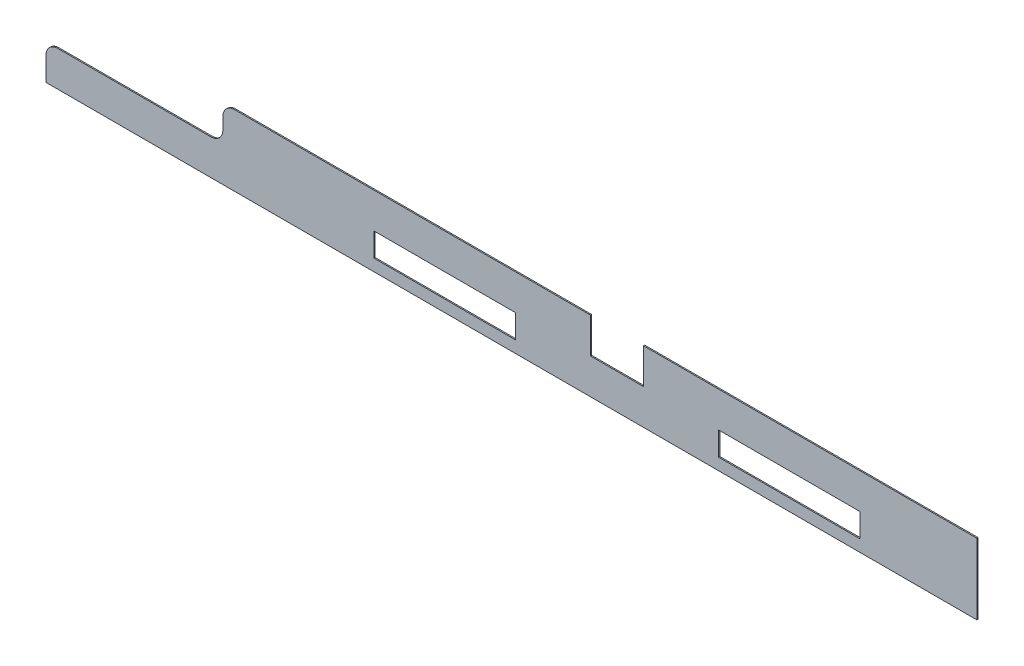
ISO-10303-21;
HEADER;
FILE_DESCRIPTION(('STEP AP214'),'2;1');
FILE_NAME('part.step','',(''),(''),'','','');
FILE_SCHEMA(('AUTOMOTIVE_DESIGN { 1 0 10303 214 1 1 1 1 }'));
ENDSEC;
DATA;
#1=APPLICATION_CONTEXT('core data for automotive mechanical design processes');
#2=APPLICATION_PROTOCOL_DEFINITION('international standard','automotive_design',2000,#1);
#3=PRODUCT_CONTEXT('',#1,'mechanical');
#4=PRODUCT('Part','Part','',(#3));
#5=PRODUCT_RELATED_PRODUCT_CATEGORY('part','',(#4));
#6=PRODUCT_DEFINITION_FORMATION('','',#4);
#7=PRODUCT_DEFINITION_CONTEXT('part definition',#1,'design');
#8=PRODUCT_DEFINITION('design','',#6,#7);
#9=PRODUCT_DEFINITION_SHAPE('','',#8);
#10=(LENGTH_UNIT() NAMED_UNIT(*) SI_UNIT(.MILLI.,.METRE.));
#11=(NAMED_UNIT(*) PLANE_ANGLE_UNIT() SI_UNIT($,.RADIAN.));
#12=(NAMED_UNIT(*) SI_UNIT($,.STERADIAN.) SOLID_ANGLE_UNIT());
#13=UNCERTAINTY_MEASURE_WITH_UNIT(LENGTH_MEASURE(1.E-05),#10,'distance_accuracy_value','');
#14=(GEOMETRIC_REPRESENTATION_CONTEXT(3) GLOBAL_UNCERTAINTY_ASSIGNED_CONTEXT((#13)) GLOBAL_UNIT_ASSIGNED_CONTEXT((#10,
#11,#12)) REPRESENTATION_CONTEXT('',''));
#15=CARTESIAN_POINT('',(0.,0.,0.));
#16=DIRECTION('',(0.,0.,1.));
#17=DIRECTION('',(1.,0.,0.));
#18=AXIS2_PLACEMENT_3D('',#15,#16,#17);
#19=CARTESIAN_POINT('',(0.,0.,2.00000000000011));
#20=DIRECTION('',(0.,0.,1.));
#21=DIRECTION('',(1.,0.,0.));
#22=AXIS2_PLACEMENT_3D('',#19,#20,#21);
#23=PLANE('',#22);
#24=DIRECTION('',(-1.,0.,0.));
#25=VECTOR('',#24,1.);
#26=CARTESIAN_POINT('',(-668.61511365349,60.0000000000001,2.00000000000011));
#27=LINE('',#26,#25);
#28=CARTESIAN_POINT('',(-688.61511365349,60.0000000000001,1.99999999999945));
#29=VERTEX_POINT('',#28);
#30=CARTESIAN_POINT('',(-948.61511365349,59.9999999999998,1.99999999999956));
#31=VERTEX_POINT('',#30);
#32=EDGE_CURVE('E266',#29,#31,#27,.T.);
#33=ORIENTED_EDGE('',*,*,#32,.T.);
#34=CARTESIAN_POINT('',(-948.61511365349,39.9999999999998,1.99999999999956));
#35=DIRECTION('',(0.,0.,1.));
#36=DIRECTION('',(1.,0.,0.));
#37=AXIS2_PLACEMENT_3D('',#34,#35,#36);
#38=CIRCLE('',#37,20.);
#39=CARTESIAN_POINT('',(-968.61511365349,40.,2.00000000000022));
#40=VERTEX_POINT('',#39);
#41=EDGE_CURVE('E326',#31,#40,#38,.T.);
#42=ORIENTED_EDGE('',*,*,#41,.T.);
#43=DIRECTION('',(0.,-1.,0.));
#44=VECTOR('',#43,1.);
#45=CARTESIAN_POINT('',(-968.61511365349,59.9999999999998,1.99999999999934));
#46=LINE('',#45,#44);
#47=CARTESIAN_POINT('',(-968.61511365349,0.,1.99999999999945));
#48=VERTEX_POINT('',#47);
#49=EDGE_CURVE('E269',#40,#48,#46,.T.);
#50=ORIENTED_EDGE('',*,*,#49,.T.);
#51=DIRECTION('',(1.,0.,0.));
#52=VECTOR('',#51,1.);
#53=CARTESIAN_POINT('',(-968.61511365349,0.,1.99999999999945));
#54=LINE('',#53,#52);
#55=CARTESIAN_POINT('',(610.5,2.22044604925031E-13,1.99999999999945));
#56=VERTEX_POINT('',#55);
#57=EDGE_CURVE('E249',#48,#56,#54,.T.);
#58=ORIENTED_EDGE('',*,*,#57,.T.);
#59=DIRECTION('',(0.,1.,0.));
#60=VECTOR('',#59,1.);
#61=CARTESIAN_POINT('',(610.5,2.22044604925031E-13,1.99999999999945));
#62=LINE('',#61,#60);
#63=CARTESIAN_POINT('',(610.5,120.,1.99999999999934));
#64=VERTEX_POINT('',#63);
#65=EDGE_CURVE('E251',#56,#64,#62,.T.);
#66=ORIENTED_EDGE('',*,*,#65,.T.);
#67=DIRECTION('',(-1.,0.,0.));
#68=VECTOR('',#67,1.);
#69=CARTESIAN_POINT('',(610.5,120.,1.99999999999934));
#70=LINE('',#69,#68);
#71=CARTESIAN_POINT('',(44.9999999999999,120.,1.99999999999945));
#72=VERTEX_POINT('',#71);
#73=EDGE_CURVE('E254',#64,#72,#70,.T.);
#74=ORIENTED_EDGE('',*,*,#73,.T.);
#75=DIRECTION('',(0.,-1.,0.));
#76=VECTOR('',#75,1.);
#77=CARTESIAN_POINT('',(44.9999999999999,120.,1.99999999999945));
#78=LINE('',#77,#76);
#79=CARTESIAN_POINT('',(45.0000000000001,60.0000000000001,2.00000000000022));
#80=VERTEX_POINT('',#79);
#81=EDGE_CURVE('E256',#72,#80,#78,.T.);
#82=ORIENTED_EDGE('',*,*,#81,.T.);
#83=DIRECTION('',(-1.,0.,0.));
#84=VECTOR('',#83,1.);
#85=CARTESIAN_POINT('',(45.0000000000001,60.0000000000001,2.00000000000022));
#86=LINE('',#85,#84);
#87=CARTESIAN_POINT('',(-45.,60.0000000000001,1.99999999999945));
#88=VERTEX_POINT('',#87);
#89=EDGE_CURVE('E258',#80,#88,#86,.T.);
#90=ORIENTED_EDGE('',*,*,#89,.T.);
#91=DIRECTION('',(0.,1.,0.));
#92=VECTOR('',#91,1.);
#93=CARTESIAN_POINT('',(-45.,60.0000000000001,1.99999999999945));
#94=LINE('',#93,#92);
#95=CARTESIAN_POINT('',(-45.0000000000001,120.,1.99999999999945));
#96=VERTEX_POINT('',#95);
#97=EDGE_CURVE('E260',#88,#96,#94,.T.);
#98=ORIENTED_EDGE('',*,*,#97,.T.);
#99=DIRECTION('',(-1.,0.,0.));
#100=VECTOR('',#99,1.);
#101=CARTESIAN_POINT('',(-45.0000000000001,120.,1.99999999999945));
#102=LINE('',#101,#100);
#103=CARTESIAN_POINT('',(-648.61511365349,120.,2.00000000000022));
#104=VERTEX_POINT('',#103);
#105=EDGE_CURVE('E262',#96,#104,#102,.T.);
#106=ORIENTED_EDGE('',*,*,#105,.T.);
#107=CARTESIAN_POINT('',(-648.61511365349,99.9999999999999,2.00000000000011));
#108=DIRECTION('',(0.,0.,1.));
#109=DIRECTION('',(1.,0.,0.));
#110=AXIS2_PLACEMENT_3D('',#107,#108,#109);
#111=CIRCLE('',#110,20.);
#112=CARTESIAN_POINT('',(-668.61511365349,99.9999999999996,1.99999999999934));
#113=VERTEX_POINT('',#112);
#114=EDGE_CURVE('E54',#104,#113,#111,.T.);
#115=ORIENTED_EDGE('',*,*,#114,.T.);
#116=DIRECTION('',(0.,-1.,0.));
#117=VECTOR('',#116,1.);
#118=CARTESIAN_POINT('',(-668.61511365349,119.999999999999,2.00000000000022));
#119=LINE('',#118,#117);
#120=CARTESIAN_POINT('',(-668.61511365349,79.9999999999998,2.00000000000011));
#121=VERTEX_POINT('',#120);
#122=EDGE_CURVE('E264',#113,#121,#119,.T.);
#123=ORIENTED_EDGE('',*,*,#122,.T.);
#124=CARTESIAN_POINT('',(-688.61511365349,79.9999999999998,2.00000000000022));
#125=DIRECTION('',(0.,0.,1.));
#126=DIRECTION('',(1.,0.,0.));
#127=AXIS2_PLACEMENT_3D('',#124,#125,#126);
#128=CIRCLE('',#127,20.);
#129=EDGE_CURVE('E11',#121,#29,#128,.F.);
#130=ORIENTED_EDGE('',*,*,#129,.T.);
#131=EDGE_LOOP('',(#33,#42,#50,#58,#66,#74,#82,#90,#98,#106,#115,#123,#130));
#132=FACE_BOUND('',#131,.T.);
#133=DIRECTION('',(1.,0.,0.));
#134=VECTOR('',#133,1.);
#135=CARTESIAN_POINT('',(-412.5,20.,2.00000000000011));
#136=LINE('',#135,#134);
#137=CARTESIAN_POINT('',(-412.5,20.,2.00000000000011));
#138=VERTEX_POINT('',#137);
#139=CARTESIAN_POINT('',(-172.5,20.,2.00000000000011));
#140=VERTEX_POINT('',#139);
#141=EDGE_CURVE('E220',#138,#140,#136,.T.);
#142=ORIENTED_EDGE('',*,*,#141,.F.);
#143=DIRECTION('',(0.,-1.,0.));
#144=VECTOR('',#143,1.);
#145=CARTESIAN_POINT('',(-412.5,20.,2.00000000000011));
#146=LINE('',#145,#144);
#147=CARTESIAN_POINT('',(-412.5,59.9999999999998,2.));
#148=VERTEX_POINT('',#147);
#149=EDGE_CURVE('E218',#148,#138,#146,.T.);
#150=ORIENTED_EDGE('',*,*,#149,.F.);
#151=DIRECTION('',(-1.,0.,0.));
#152=VECTOR('',#151,1.);
#153=CARTESIAN_POINT('',(-412.5,59.9999999999998,2.));
#154=LINE('',#153,#152);
#155=CARTESIAN_POINT('',(-172.5,60.0000000000001,1.99999999999934));
#156=VERTEX_POINT('',#155);
#157=EDGE_CURVE('E226',#156,#148,#154,.T.);
#158=ORIENTED_EDGE('',*,*,#157,.F.);
#159=DIRECTION('',(0.,1.,0.));
#160=VECTOR('',#159,1.);
#161=CARTESIAN_POINT('',(-172.5,20.,2.00000000000011));
#162=LINE('',#161,#160);
#163=EDGE_CURVE('E223',#140,#156,#162,.T.);
#164=ORIENTED_EDGE('',*,*,#163,.F.);
#165=EDGE_LOOP('',(#142,#150,#158,#164));
#166=FACE_BOUND('',#165,.T.);
#167=DIRECTION('',(0.,1.,0.));
#168=VECTOR('',#167,1.);
#169=CARTESIAN_POINT('',(412.5,20.0000000000002,2.00000000000022));
#170=LINE('',#169,#168);
#171=CARTESIAN_POINT('',(412.5,20.0000000000002,2.00000000000022));
#172=VERTEX_POINT('',#171);
#173=CARTESIAN_POINT('',(412.5,60.0000000000003,1.99999999999945));
#174=VERTEX_POINT('',#173);
#175=EDGE_CURVE('E187',#172,#174,#170,.T.);
#176=ORIENTED_EDGE('',*,*,#175,.F.);
#177=DIRECTION('',(1.,0.,0.));
#178=VECTOR('',#177,1.);
#179=CARTESIAN_POINT('',(412.5,20.0000000000002,2.00000000000022));
#180=LINE('',#179,#178);
#181=CARTESIAN_POINT('',(172.5,20.,2.));
#182=VERTEX_POINT('',#181);
#183=EDGE_CURVE('E177',#182,#172,#180,.T.);
#184=ORIENTED_EDGE('',*,*,#183,.F.);
#185=DIRECTION('',(0.,-1.,0.));
#186=VECTOR('',#185,1.);
#187=CARTESIAN_POINT('',(172.5,20.,2.));
#188=LINE('',#187,#186);
#189=CARTESIAN_POINT('',(172.5,60.0000000000001,2.00000000000011));
#190=VERTEX_POINT('',#189);
#191=EDGE_CURVE('E202',#190,#182,#188,.T.);
#192=ORIENTED_EDGE('',*,*,#191,.F.);
#193=DIRECTION('',(-1.,0.,0.));
#194=VECTOR('',#193,1.);
#195=CARTESIAN_POINT('',(412.5,60.0000000000003,1.99999999999945));
#196=LINE('',#195,#194);
#197=EDGE_CURVE('E200',#174,#190,#196,.T.);
#198=ORIENTED_EDGE('',*,*,#197,.F.);
#199=EDGE_LOOP('',(#176,#184,#192,#198));
#200=FACE_BOUND('',#199,.T.);
#201=ADVANCED_FACE('F32',(#132,#166,#200),#23,.T.);
#202=CARTESIAN_POINT('',(0.,0.,0.));
#203=DIRECTION('',(0.,0.,1.));
#204=DIRECTION('',(1.,0.,0.));
#205=AXIS2_PLACEMENT_3D('',#202,#203,#204);
#206=PLANE('',#205);
#207=DIRECTION('',(0.,-1.,0.));
#208=VECTOR('',#207,1.);
#209=CARTESIAN_POINT('',(-412.5,20.,0.));
#210=LINE('',#209,#208);
#211=CARTESIAN_POINT('',(-412.5,59.9999999999998,1.11022302462516E-13));
#212=VERTEX_POINT('',#211);
#213=CARTESIAN_POINT('',(-412.5,20.,0.));
#214=VERTEX_POINT('',#213);
#215=EDGE_CURVE('E195',#212,#214,#210,.T.);
#216=ORIENTED_EDGE('',*,*,#215,.T.);
#217=DIRECTION('',(1.,0.,0.));
#218=VECTOR('',#217,1.);
#219=CARTESIAN_POINT('',(-412.5,20.,0.));
#220=LINE('',#219,#218);
#221=CARTESIAN_POINT('',(-172.5,20.,0.));
#222=VERTEX_POINT('',#221);
#223=EDGE_CURVE('E231',#214,#222,#220,.T.);
#224=ORIENTED_EDGE('',*,*,#223,.T.);
#225=DIRECTION('',(0.,1.,0.));
#226=VECTOR('',#225,1.);
#227=CARTESIAN_POINT('',(-172.5,20.,0.));
#228=LINE('',#227,#226);
#229=CARTESIAN_POINT('',(-172.5,59.9999999999998,-5.55111512312578E-13));
#230=VERTEX_POINT('',#229);
#231=EDGE_CURVE('E234',#222,#230,#228,.T.);
#232=ORIENTED_EDGE('',*,*,#231,.T.);
#233=DIRECTION('',(-1.,0.,0.));
#234=VECTOR('',#233,1.);
#235=CARTESIAN_POINT('',(-412.5,59.9999999999998,1.11022302462516E-13));
#236=LINE('',#235,#234);
#237=EDGE_CURVE('E221',#230,#212,#236,.T.);
#238=ORIENTED_EDGE('',*,*,#237,.T.);
#239=EDGE_LOOP('',(#216,#224,#232,#238));
#240=FACE_BOUND('',#239,.T.);
#241=DIRECTION('',(0.,-1.,0.));
#242=VECTOR('',#241,1.);
#243=CARTESIAN_POINT('',(-968.61511365349,59.9999999999998,-6.66133814775094E-13));
#244=LINE('',#243,#242);
#245=CARTESIAN_POINT('',(-968.61511365349,39.9999999999998,2.22044604925031E-13));
#246=VERTEX_POINT('',#245);
#247=CARTESIAN_POINT('',(-968.61511365349,-2.22044604925031E-13,-4.44089209850063E-13));
#248=VERTEX_POINT('',#247);
#249=EDGE_CURVE('E252',#246,#248,#244,.T.);
#250=ORIENTED_EDGE('',*,*,#249,.F.);
#251=CARTESIAN_POINT('',(-948.61511365349,39.9999999999998,-5.55111512312578E-13));
#252=DIRECTION('',(0.,0.,1.));
#253=DIRECTION('',(1.,0.,0.));
#254=AXIS2_PLACEMENT_3D('',#251,#252,#253);
#255=CIRCLE('',#254,20.);
#256=CARTESIAN_POINT('',(-948.61511365349,59.9999999999998,-6.66133814775094E-13));
#257=VERTEX_POINT('',#256);
#258=EDGE_CURVE('E318',#246,#257,#255,.F.);
#259=ORIENTED_EDGE('',*,*,#258,.T.);
#260=DIRECTION('',(-1.,0.,0.));
#261=VECTOR('',#260,1.);
#262=CARTESIAN_POINT('',(-668.61511365349,59.9999999999998,1.11022302462516E-13));
#263=LINE('',#262,#261);
#264=CARTESIAN_POINT('',(-688.61511365349,59.9999999999998,-5.55111512312578E-13));
#265=VERTEX_POINT('',#264);
#266=EDGE_CURVE('E289',#265,#257,#263,.T.);
#267=ORIENTED_EDGE('',*,*,#266,.F.);
#268=CARTESIAN_POINT('',(-688.61511365349,79.9999999999998,1.11022302462516E-13));
#269=DIRECTION('',(0.,0.,1.));
#270=DIRECTION('',(1.,0.,0.));
#271=AXIS2_PLACEMENT_3D('',#268,#269,#270);
#272=CIRCLE('',#271,20.);
#273=CARTESIAN_POINT('',(-668.61511365349,79.9999999999998,0.));
#274=VERTEX_POINT('',#273);
#275=EDGE_CURVE('E40',#265,#274,#272,.T.);
#276=ORIENTED_EDGE('',*,*,#275,.T.);
#277=DIRECTION('',(0.,-1.,0.));
#278=VECTOR('',#277,1.);
#279=CARTESIAN_POINT('',(-668.61511365349,119.999999999999,0.));
#280=LINE('',#279,#278);
#281=CARTESIAN_POINT('',(-668.61511365349,99.9999999999994,-5.55111512312578E-13));
#282=VERTEX_POINT('',#281);
#283=EDGE_CURVE('E287',#282,#274,#280,.T.);
#284=ORIENTED_EDGE('',*,*,#283,.F.);
#285=CARTESIAN_POINT('',(-648.61511365349,99.9999999999996,2.22044604925031E-13));
#286=DIRECTION('',(0.,0.,1.));
#287=DIRECTION('',(1.,0.,0.));
#288=AXIS2_PLACEMENT_3D('',#285,#286,#287);
#289=CIRCLE('',#288,20.);
#290=CARTESIAN_POINT('',(-648.61511365349,120.,1.11022302462516E-13));
#291=VERTEX_POINT('',#290);
#292=EDGE_CURVE('E316',#282,#291,#289,.F.);
#293=ORIENTED_EDGE('',*,*,#292,.T.);
#294=DIRECTION('',(-1.,0.,0.));
#295=VECTOR('',#294,1.);
#296=CARTESIAN_POINT('',(-610.5,120.,-6.66133814775094E-13));
#297=LINE('',#296,#295);
#298=CARTESIAN_POINT('',(-45.,120.,-5.55111512312578E-13));
#299=VERTEX_POINT('',#298);
#300=EDGE_CURVE('E284',#299,#291,#297,.T.);
#301=ORIENTED_EDGE('',*,*,#300,.F.);
#302=DIRECTION('',(0.,1.,0.));
#303=VECTOR('',#302,1.);
#304=CARTESIAN_POINT('',(-44.9999999999998,60.0000000000001,-5.55111512312578E-13));
#305=LINE('',#304,#303);
#306=CARTESIAN_POINT('',(-44.9999999999998,60.0000000000001,-5.55111512312578E-13));
#307=VERTEX_POINT('',#306);
#308=EDGE_CURVE('E281',#307,#299,#305,.T.);
#309=ORIENTED_EDGE('',*,*,#308,.F.);
#310=DIRECTION('',(-1.,0.,0.));
#311=VECTOR('',#310,1.);
#312=CARTESIAN_POINT('',(45.,60.0000000000001,1.11022302462516E-13));
#313=LINE('',#312,#311);
#314=CARTESIAN_POINT('',(45.,60.0000000000001,1.11022302462516E-13));
#315=VERTEX_POINT('',#314);
#316=EDGE_CURVE('E279',#315,#307,#313,.T.);
#317=ORIENTED_EDGE('',*,*,#316,.F.);
#318=DIRECTION('',(0.,-1.,0.));
#319=VECTOR('',#318,1.);
#320=CARTESIAN_POINT('',(45.,120.,-6.66133814775094E-13));
#321=LINE('',#320,#319);
#322=CARTESIAN_POINT('',(45.,120.,-6.66133814775094E-13));
#323=VERTEX_POINT('',#322);
#324=EDGE_CURVE('E277',#323,#315,#321,.T.);
#325=ORIENTED_EDGE('',*,*,#324,.F.);
#326=DIRECTION('',(-1.,0.,0.));
#327=VECTOR('',#326,1.);
#328=CARTESIAN_POINT('',(610.5,120.,-4.44089209850063E-13));
#329=LINE('',#328,#327);
#330=CARTESIAN_POINT('',(610.5,120.,-4.44089209850063E-13));
#331=VERTEX_POINT('',#330);
#332=EDGE_CURVE('E275',#331,#323,#329,.T.);
#333=ORIENTED_EDGE('',*,*,#332,.F.);
#334=DIRECTION('',(0.,1.,0.));
#335=VECTOR('',#334,1.);
#336=CARTESIAN_POINT('',(610.5,2.22044604925031E-13,-5.55111512312578E-13));
#337=LINE('',#336,#335);
#338=CARTESIAN_POINT('',(610.5,2.22044604925031E-13,-5.55111512312578E-13));
#339=VERTEX_POINT('',#338);
#340=EDGE_CURVE('E273',#339,#331,#337,.T.);
#341=ORIENTED_EDGE('',*,*,#340,.F.);
#342=DIRECTION('',(1.,0.,0.));
#343=VECTOR('',#342,1.);
#344=CARTESIAN_POINT('',(-610.5,0.,2.22044604925031E-13));
#345=LINE('',#344,#343);
#346=EDGE_CURVE('E248',#248,#339,#345,.T.);
#347=ORIENTED_EDGE('',*,*,#346,.F.);
#348=EDGE_LOOP('',(#250,#259,#267,#276,#284,#293,#301,#309,#317,#325,#333,#341,#347));
#349=FACE_BOUND('',#348,.T.);
#350=DIRECTION('',(1.,0.,0.));
#351=VECTOR('',#350,1.);
#352=CARTESIAN_POINT('',(412.5,20.,1.11022302462516E-13));
#353=LINE('',#352,#351);
#354=CARTESIAN_POINT('',(172.5,20.,0.));
#355=VERTEX_POINT('',#354);
#356=CARTESIAN_POINT('',(412.5,20.,1.11022302462516E-13));
#357=VERTEX_POINT('',#356);
#358=EDGE_CURVE('E206',#355,#357,#353,.T.);
#359=ORIENTED_EDGE('',*,*,#358,.T.);
#360=DIRECTION('',(0.,1.,0.));
#361=VECTOR('',#360,1.);
#362=CARTESIAN_POINT('',(412.5,20.,1.11022302462516E-13));
#363=LINE('',#362,#361);
#364=CARTESIAN_POINT('',(412.5,60.0000000000003,-6.66133814775094E-13));
#365=VERTEX_POINT('',#364);
#366=EDGE_CURVE('E194',#357,#365,#363,.T.);
#367=ORIENTED_EDGE('',*,*,#366,.T.);
#368=DIRECTION('',(-1.,0.,0.));
#369=VECTOR('',#368,1.);
#370=CARTESIAN_POINT('',(412.5,60.0000000000003,-6.66133814775094E-13));
#371=LINE('',#370,#369);
#372=CARTESIAN_POINT('',(172.5,60.0000000000001,1.11022302462516E-13));
#373=VERTEX_POINT('',#372);
#374=EDGE_CURVE('E209',#365,#373,#371,.T.);
#375=ORIENTED_EDGE('',*,*,#374,.T.);
#376=DIRECTION('',(0.,-1.,0.));
#377=VECTOR('',#376,1.);
#378=CARTESIAN_POINT('',(172.5,20.,0.));
#379=LINE('',#378,#377);
#380=EDGE_CURVE('E188',#373,#355,#379,.T.);
#381=ORIENTED_EDGE('',*,*,#380,.T.);
#382=EDGE_LOOP('',(#359,#367,#375,#381));
#383=FACE_BOUND('',#382,.T.);
#384=ADVANCED_FACE('F337',(#240,#349,#383),#206,.F.);
#385=CARTESIAN_POINT('',(-610.5,-2.22044604925031E-13,2.));
#386=DIRECTION('',(0.,1.,0.));
#387=DIRECTION('',(0.,0.,1.));
#388=AXIS2_PLACEMENT_3D('',#385,#386,#387);
#389=PLANE('',#388);
#390=ORIENTED_EDGE('',*,*,#346,.T.);
#391=DIRECTION('',(0.,0.,-1.));
#392=VECTOR('',#391,1.);
#393=CARTESIAN_POINT('',(610.5,2.22044604925031E-13,1.99999999999945));
#394=LINE('',#393,#392);
#395=EDGE_CURVE('E310',#56,#339,#394,.T.);
#396=ORIENTED_EDGE('',*,*,#395,.F.);
#397=ORIENTED_EDGE('',*,*,#57,.F.);
#398=DIRECTION('',(0.,0.,-1.));
#399=VECTOR('',#398,1.);
#400=CARTESIAN_POINT('',(-968.61511365349,0.,1.99999999999945));
#401=LINE('',#400,#399);
#402=EDGE_CURVE('E271',#48,#248,#401,.T.);
#403=ORIENTED_EDGE('',*,*,#402,.T.);
#404=EDGE_LOOP('',(#390,#396,#397,#403));
#405=FACE_BOUND('',#404,.T.);
#406=ADVANCED_FACE('F362',(#405),#389,.F.);
#407=CARTESIAN_POINT('',(610.5,2.22044604925031E-13,1.99999999999945));
#408=DIRECTION('',(-1.,0.,0.));
#409=DIRECTION('',(0.,0.,1.));
#410=AXIS2_PLACEMENT_3D('',#407,#408,#409);
#411=PLANE('',#410);
#412=ORIENTED_EDGE('',*,*,#340,.T.);
#413=DIRECTION('',(0.,0.,-1.));
#414=VECTOR('',#413,1.);
#415=CARTESIAN_POINT('',(610.5,120.,1.99999999999934));
#416=LINE('',#415,#414);
#417=EDGE_CURVE('E307',#64,#331,#416,.T.);
#418=ORIENTED_EDGE('',*,*,#417,.F.);
#419=ORIENTED_EDGE('',*,*,#65,.F.);
#420=ORIENTED_EDGE('',*,*,#395,.T.);
#421=EDGE_LOOP('',(#412,#418,#419,#420));
#422=FACE_BOUND('',#421,.T.);
#423=ADVANCED_FACE('F368',(#422),#411,.F.);
#424=CARTESIAN_POINT('',(610.5,120.,1.99999999999934));
#425=DIRECTION('',(0.,-1.,0.));
#426=DIRECTION('',(1.,0.,0.));
#427=AXIS2_PLACEMENT_3D('',#424,#425,#426);
#428=PLANE('',#427);
#429=ORIENTED_EDGE('',*,*,#332,.T.);
#430=DIRECTION('',(0.,0.,-1.));
#431=VECTOR('',#430,1.);
#432=CARTESIAN_POINT('',(44.9999999999999,120.,1.99999999999945));
#433=LINE('',#432,#431);
#434=EDGE_CURVE('E304',#72,#323,#433,.T.);
#435=ORIENTED_EDGE('',*,*,#434,.F.);
#436=ORIENTED_EDGE('',*,*,#73,.F.);
#437=ORIENTED_EDGE('',*,*,#417,.T.);
#438=EDGE_LOOP('',(#429,#435,#436,#437));
#439=FACE_BOUND('',#438,.T.);
#440=ADVANCED_FACE('F372',(#439),#428,.F.);
#441=CARTESIAN_POINT('',(44.9999999999999,120.,1.99999999999945));
#442=DIRECTION('',(1.,0.,0.));
#443=DIRECTION('',(0.,0.,-1.));
#444=AXIS2_PLACEMENT_3D('',#441,#442,#443);
#445=PLANE('',#444);
#446=ORIENTED_EDGE('',*,*,#324,.T.);
#447=DIRECTION('',(0.,0.,-1.));
#448=VECTOR('',#447,1.);
#449=CARTESIAN_POINT('',(45.0000000000001,60.0000000000001,2.00000000000022));
#450=LINE('',#449,#448);
#451=EDGE_CURVE('E301',#80,#315,#450,.T.);
#452=ORIENTED_EDGE('',*,*,#451,.F.);
#453=ORIENTED_EDGE('',*,*,#81,.F.);
#454=ORIENTED_EDGE('',*,*,#434,.T.);
#455=EDGE_LOOP('',(#446,#452,#453,#454));
#456=FACE_BOUND('',#455,.T.);
#457=ADVANCED_FACE('F377',(#456),#445,.F.);
#458=CARTESIAN_POINT('',(45.0000000000001,60.0000000000001,2.00000000000022));
#459=DIRECTION('',(0.,-1.,0.));
#460=DIRECTION('',(1.,0.,0.));
#461=AXIS2_PLACEMENT_3D('',#458,#459,#460);
#462=PLANE('',#461);
#463=ORIENTED_EDGE('',*,*,#316,.T.);
#464=DIRECTION('',(0.,0.,-1.));
#465=VECTOR('',#464,1.);
#466=CARTESIAN_POINT('',(-45.,60.0000000000001,1.99999999999945));
#467=LINE('',#466,#465);
#468=EDGE_CURVE('E298',#88,#307,#467,.T.);
#469=ORIENTED_EDGE('',*,*,#468,.F.);
#470=ORIENTED_EDGE('',*,*,#89,.F.);
#471=ORIENTED_EDGE('',*,*,#451,.T.);
#472=EDGE_LOOP('',(#463,#469,#470,#471));
#473=FACE_BOUND('',#472,.T.);
#474=ADVANCED_FACE('F383',(#473),#462,.F.);
#475=CARTESIAN_POINT('',(-45.,60.0000000000001,1.99999999999945));
#476=DIRECTION('',(-1.,0.,0.));
#477=DIRECTION('',(0.,0.,1.));
#478=AXIS2_PLACEMENT_3D('',#475,#476,#477);
#479=PLANE('',#478);
#480=ORIENTED_EDGE('',*,*,#308,.T.);
#481=DIRECTION('',(0.,0.,-1.));
#482=VECTOR('',#481,1.);
#483=CARTESIAN_POINT('',(-45.0000000000001,120.,1.99999999999945));
#484=LINE('',#483,#482);
#485=EDGE_CURVE('E295',#96,#299,#484,.T.);
#486=ORIENTED_EDGE('',*,*,#485,.F.);
#487=ORIENTED_EDGE('',*,*,#97,.F.);
#488=ORIENTED_EDGE('',*,*,#468,.T.);
#489=EDGE_LOOP('',(#480,#486,#487,#488));
#490=FACE_BOUND('',#489,.T.);
#491=ADVANCED_FACE('F387',(#490),#479,.F.);
#492=CARTESIAN_POINT('',(-610.5,120.,1.99999999999945));
#493=DIRECTION('',(0.,-1.,0.));
#494=DIRECTION('',(1.,0.,0.));
#495=AXIS2_PLACEMENT_3D('',#492,#493,#494);
#496=PLANE('',#495);
#497=ORIENTED_EDGE('',*,*,#300,.T.);
#498=DIRECTION('',(0.,0.,-1.));
#499=VECTOR('',#498,1.);
#500=CARTESIAN_POINT('',(-648.61511365349,120.,2.00000000000022));
#501=LINE('',#500,#499);
#502=EDGE_CURVE('E332',#291,#104,#501,.F.);
#503=ORIENTED_EDGE('',*,*,#502,.T.);
#504=ORIENTED_EDGE('',*,*,#105,.F.);
#505=ORIENTED_EDGE('',*,*,#485,.T.);
#506=EDGE_LOOP('',(#497,#503,#504,#505));
#507=FACE_BOUND('',#506,.T.);
#508=ADVANCED_FACE('F390',(#507),#496,.F.);
#509=CARTESIAN_POINT('',(-668.61511365349,119.999999999999,2.00000000000022));
#510=DIRECTION('',(1.,0.,0.));
#511=DIRECTION('',(0.,0.,-1.));
#512=AXIS2_PLACEMENT_3D('',#509,#510,#511);
#513=PLANE('',#512);
#514=ORIENTED_EDGE('',*,*,#283,.T.);
#515=DIRECTION('',(0.,0.,-1.));
#516=VECTOR('',#515,1.);
#517=CARTESIAN_POINT('',(-668.61511365349,79.9999999999998,2.00000000000011));
#518=LINE('',#517,#516);
#519=EDGE_CURVE('E47',#274,#121,#518,.F.);
#520=ORIENTED_EDGE('',*,*,#519,.T.);
#521=ORIENTED_EDGE('',*,*,#122,.F.);
#522=DIRECTION('',(0.,0.,-1.));
#523=VECTOR('',#522,1.);
#524=CARTESIAN_POINT('',(-668.61511365349,99.9999999999996,1.99999999999934));
#525=LINE('',#524,#523);
#526=EDGE_CURVE('E328',#113,#282,#525,.T.);
#527=ORIENTED_EDGE('',*,*,#526,.T.);
#528=EDGE_LOOP('',(#514,#520,#521,#527));
#529=FACE_BOUND('',#528,.T.);
#530=ADVANCED_FACE('F341',(#529),#513,.F.);
#531=CARTESIAN_POINT('',(-668.61511365349,60.0000000000001,2.00000000000011));
#532=DIRECTION('',(0.,-1.,0.));
#533=DIRECTION('',(1.,0.,0.));
#534=AXIS2_PLACEMENT_3D('',#531,#532,#533);
#535=PLANE('',#534);
#536=ORIENTED_EDGE('',*,*,#266,.T.);
#537=DIRECTION('',(0.,0.,-1.));
#538=VECTOR('',#537,1.);
#539=CARTESIAN_POINT('',(-948.61511365349,59.9999999999998,1.99999999999956));
#540=LINE('',#539,#538);
#541=EDGE_CURVE('E323',#257,#31,#540,.F.);
#542=ORIENTED_EDGE('',*,*,#541,.T.);
#543=ORIENTED_EDGE('',*,*,#32,.F.);
#544=DIRECTION('',(0.,0.,-1.));
#545=VECTOR('',#544,1.);
#546=CARTESIAN_POINT('',(-688.61511365349,59.9999999999998,-5.55111512312578E-13));
#547=LINE('',#546,#545);
#548=EDGE_CURVE('E320',#29,#265,#547,.T.);
#549=ORIENTED_EDGE('',*,*,#548,.T.);
#550=EDGE_LOOP('',(#536,#542,#543,#549));
#551=FACE_BOUND('',#550,.T.);
#552=ADVANCED_FACE('F349',(#551),#535,.F.);
#553=CARTESIAN_POINT('',(-968.61511365349,59.9999999999998,1.99999999999934));
#554=DIRECTION('',(1.,0.,0.));
#555=DIRECTION('',(0.,0.,-1.));
#556=AXIS2_PLACEMENT_3D('',#553,#554,#555);
#557=PLANE('',#556);
#558=ORIENTED_EDGE('',*,*,#49,.F.);
#559=DIRECTION('',(0.,0.,-1.));
#560=VECTOR('',#559,1.);
#561=CARTESIAN_POINT('',(-968.61511365349,40.,2.00000000000022));
#562=LINE('',#561,#560);
#563=EDGE_CURVE('E313',#40,#246,#562,.T.);
#564=ORIENTED_EDGE('',*,*,#563,.T.);
#565=ORIENTED_EDGE('',*,*,#249,.T.);
#566=ORIENTED_EDGE('',*,*,#402,.F.);
#567=EDGE_LOOP('',(#558,#564,#565,#566));
#568=FACE_BOUND('',#567,.T.);
#569=ADVANCED_FACE('F357',(#568),#557,.F.);
#570=CARTESIAN_POINT('',(-412.5,20.,2.00000000000011));
#571=DIRECTION('',(1.,0.,0.));
#572=DIRECTION('',(0.,0.,-1.));
#573=AXIS2_PLACEMENT_3D('',#570,#571,#572);
#574=PLANE('',#573);
#575=ORIENTED_EDGE('',*,*,#215,.F.);
#576=DIRECTION('',(0.,0.,-1.));
#577=VECTOR('',#576,1.);
#578=CARTESIAN_POINT('',(-412.5,59.9999999999998,2.));
#579=LINE('',#578,#577);
#580=EDGE_CURVE('E228',#148,#212,#579,.T.);
#581=ORIENTED_EDGE('',*,*,#580,.F.);
#582=ORIENTED_EDGE('',*,*,#149,.T.);
#583=DIRECTION('',(0.,0.,-1.));
#584=VECTOR('',#583,1.);
#585=CARTESIAN_POINT('',(-412.5,20.,2.00000000000011));
#586=LINE('',#585,#584);
#587=EDGE_CURVE('E245',#138,#214,#586,.T.);
#588=ORIENTED_EDGE('',*,*,#587,.T.);
#589=EDGE_LOOP('',(#575,#581,#582,#588));
#590=FACE_BOUND('',#589,.T.);
#591=ADVANCED_FACE('F405',(#590),#574,.T.);
#592=CARTESIAN_POINT('',(-412.5,20.,2.00000000000011));
#593=DIRECTION('',(0.,1.,0.));
#594=DIRECTION('',(0.,0.,1.));
#595=AXIS2_PLACEMENT_3D('',#592,#593,#594);
#596=PLANE('',#595);
#597=ORIENTED_EDGE('',*,*,#223,.F.);
#598=ORIENTED_EDGE('',*,*,#587,.F.);
#599=ORIENTED_EDGE('',*,*,#141,.T.);
#600=DIRECTION('',(0.,0.,-1.));
#601=VECTOR('',#600,1.);
#602=CARTESIAN_POINT('',(-172.5,20.,2.00000000000011));
#603=LINE('',#602,#601);
#604=EDGE_CURVE('E243',#140,#222,#603,.T.);
#605=ORIENTED_EDGE('',*,*,#604,.T.);
#606=EDGE_LOOP('',(#597,#598,#599,#605));
#607=FACE_BOUND('',#606,.T.);
#608=ADVANCED_FACE('F453',(#607),#596,.T.);
#609=CARTESIAN_POINT('',(-172.5,20.,2.00000000000011));
#610=DIRECTION('',(-1.,0.,0.));
#611=DIRECTION('',(0.,0.,1.));
#612=AXIS2_PLACEMENT_3D('',#609,#610,#611);
#613=PLANE('',#612);
#614=ORIENTED_EDGE('',*,*,#231,.F.);
#615=ORIENTED_EDGE('',*,*,#604,.F.);
#616=ORIENTED_EDGE('',*,*,#163,.T.);
#617=DIRECTION('',(0.,0.,-1.));
#618=VECTOR('',#617,1.);
#619=CARTESIAN_POINT('',(-172.5,60.0000000000001,1.99999999999934));
#620=LINE('',#619,#618);
#621=EDGE_CURVE('E241',#156,#230,#620,.T.);
#622=ORIENTED_EDGE('',*,*,#621,.T.);
#623=EDGE_LOOP('',(#614,#615,#616,#622));
#624=FACE_BOUND('',#623,.T.);
#625=ADVANCED_FACE('F450',(#624),#613,.T.);
#626=CARTESIAN_POINT('',(-412.5,59.9999999999998,2.));
#627=DIRECTION('',(0.,-1.,0.));
#628=DIRECTION('',(0.,0.,-1.));
#629=AXIS2_PLACEMENT_3D('',#626,#627,#628);
#630=PLANE('',#629);
#631=ORIENTED_EDGE('',*,*,#237,.F.);
#632=ORIENTED_EDGE('',*,*,#621,.F.);
#633=ORIENTED_EDGE('',*,*,#157,.T.);
#634=ORIENTED_EDGE('',*,*,#580,.T.);
#635=EDGE_LOOP('',(#631,#632,#633,#634));
#636=FACE_BOUND('',#635,.T.);
#637=ADVANCED_FACE('F447',(#636),#630,.T.);
#638=CARTESIAN_POINT('',(412.5,20.0000000000002,2.00000000000022));
#639=DIRECTION('',(0.,1.,0.));
#640=DIRECTION('',(0.,0.,1.));
#641=AXIS2_PLACEMENT_3D('',#638,#639,#640);
#642=PLANE('',#641);
#643=ORIENTED_EDGE('',*,*,#358,.F.);
#644=DIRECTION('',(0.,0.,-1.));
#645=VECTOR('',#644,1.);
#646=CARTESIAN_POINT('',(172.5,20.,2.));
#647=LINE('',#646,#645);
#648=EDGE_CURVE('E183',#182,#355,#647,.T.);
#649=ORIENTED_EDGE('',*,*,#648,.F.);
#650=ORIENTED_EDGE('',*,*,#183,.T.);
#651=DIRECTION('',(0.,0.,-1.));
#652=VECTOR('',#651,1.);
#653=CARTESIAN_POINT('',(412.5,20.0000000000002,2.00000000000022));
#654=LINE('',#653,#652);
#655=EDGE_CURVE('E180',#172,#357,#654,.T.);
#656=ORIENTED_EDGE('',*,*,#655,.T.);
#657=EDGE_LOOP('',(#643,#649,#650,#656));
#658=FACE_BOUND('',#657,.T.);
#659=ADVANCED_FACE('F179',(#658),#642,.T.);
#660=CARTESIAN_POINT('',(412.5,20.0000000000002,2.00000000000022));
#661=DIRECTION('',(-1.,0.,0.));
#662=DIRECTION('',(0.,0.,1.));
#663=AXIS2_PLACEMENT_3D('',#660,#661,#662);
#664=PLANE('',#663);
#665=ORIENTED_EDGE('',*,*,#366,.F.);
#666=ORIENTED_EDGE('',*,*,#655,.F.);
#667=ORIENTED_EDGE('',*,*,#175,.T.);
#668=DIRECTION('',(0.,0.,-1.));
#669=VECTOR('',#668,1.);
#670=CARTESIAN_POINT('',(412.5,60.0000000000003,1.99999999999945));
#671=LINE('',#670,#669);
#672=EDGE_CURVE('E196',#174,#365,#671,.T.);
#673=ORIENTED_EDGE('',*,*,#672,.T.);
#674=EDGE_LOOP('',(#665,#666,#667,#673));
#675=FACE_BOUND('',#674,.T.);
#676=ADVANCED_FACE('F191',(#675),#664,.T.);
#677=CARTESIAN_POINT('',(412.5,60.0000000000003,1.99999999999945));
#678=DIRECTION('',(0.,-1.,0.));
#679=DIRECTION('',(0.,0.,-1.));
#680=AXIS2_PLACEMENT_3D('',#677,#678,#679);
#681=PLANE('',#680);
#682=ORIENTED_EDGE('',*,*,#374,.F.);
#683=ORIENTED_EDGE('',*,*,#672,.F.);
#684=ORIENTED_EDGE('',*,*,#197,.T.);
#685=DIRECTION('',(0.,0.,-1.));
#686=VECTOR('',#685,1.);
#687=CARTESIAN_POINT('',(172.5,60.0000000000001,2.00000000000011));
#688=LINE('',#687,#686);
#689=EDGE_CURVE('E215',#190,#373,#688,.T.);
#690=ORIENTED_EDGE('',*,*,#689,.T.);
#691=EDGE_LOOP('',(#682,#683,#684,#690));
#692=FACE_BOUND('',#691,.T.);
#693=ADVANCED_FACE('F433',(#692),#681,.T.);
#694=CARTESIAN_POINT('',(172.5,20.,2.));
#695=DIRECTION('',(1.,0.,0.));
#696=DIRECTION('',(0.,0.,-1.));
#697=AXIS2_PLACEMENT_3D('',#694,#695,#696);
#698=PLANE('',#697);
#699=ORIENTED_EDGE('',*,*,#380,.F.);
#700=ORIENTED_EDGE('',*,*,#689,.F.);
#701=ORIENTED_EDGE('',*,*,#191,.T.);
#702=ORIENTED_EDGE('',*,*,#648,.T.);
#703=EDGE_LOOP('',(#699,#700,#701,#702));
#704=FACE_BOUND('',#703,.T.);
#705=ADVANCED_FACE('F429',(#704),#698,.T.);
#706=CARTESIAN_POINT('',(-948.61511365349,39.9999999999998,1.99999999999956));
#707=DIRECTION('',(0.,0.,-1.));
#708=DIRECTION('',(-1.,0.,0.));
#709=AXIS2_PLACEMENT_3D('',#706,#707,#708);
#710=CYLINDRICAL_SURFACE('',#709,20.);
#711=ORIENTED_EDGE('',*,*,#41,.F.);
#712=ORIENTED_EDGE('',*,*,#541,.F.);
#713=ORIENTED_EDGE('',*,*,#258,.F.);
#714=ORIENTED_EDGE('',*,*,#563,.F.);
#715=EDGE_LOOP('',(#711,#712,#713,#714));
#716=FACE_BOUND('',#715,.T.);
#717=ADVANCED_FACE('F352',(#716),#710,.T.);
#718=CARTESIAN_POINT('',(-688.61511365349,79.9999999999998,2.00000000000022));
#719=DIRECTION('',(0.,0.,1.));
#720=DIRECTION('',(1.,0.,0.));
#721=AXIS2_PLACEMENT_3D('',#718,#719,#720);
#722=CYLINDRICAL_SURFACE('',#721,20.);
#723=ORIENTED_EDGE('',*,*,#129,.F.);
#724=ORIENTED_EDGE('',*,*,#519,.F.);
#725=ORIENTED_EDGE('',*,*,#275,.F.);
#726=ORIENTED_EDGE('',*,*,#548,.F.);
#727=EDGE_LOOP('',(#723,#724,#725,#726));
#728=FACE_BOUND('',#727,.T.);
#729=ADVANCED_FACE('F344',(#728),#722,.F.);
#730=CARTESIAN_POINT('',(-648.61511365349,99.9999999999999,2.00000000000011));
#731=DIRECTION('',(0.,0.,-1.));
#732=DIRECTION('',(-1.,0.,0.));
#733=AXIS2_PLACEMENT_3D('',#730,#731,#732);
#734=CYLINDRICAL_SURFACE('',#733,20.);
#735=ORIENTED_EDGE('',*,*,#114,.F.);
#736=ORIENTED_EDGE('',*,*,#502,.F.);
#737=ORIENTED_EDGE('',*,*,#292,.F.);
#738=ORIENTED_EDGE('',*,*,#526,.F.);
#739=EDGE_LOOP('',(#735,#736,#737,#738));
#740=FACE_BOUND('',#739,.T.);
#741=ADVANCED_FACE('F34',(#740),#734,.T.);
#742=CLOSED_SHELL('',(#201,#384,#406,#423,#440,#457,#474,#491,#508,#530,#552,#569,#591,#608,
#625,#637,#659,#676,#693,#705,#717,#729,#741));
#743=MANIFOLD_SOLID_BREP('B2',#742);
#744=ADVANCED_BREP_SHAPE_REPRESENTATION('',(#18,#743),#14);
#745=SHAPE_DEFINITION_REPRESENTATION(#9,#744);
ENDSEC;
END-ISO-10303-21;
